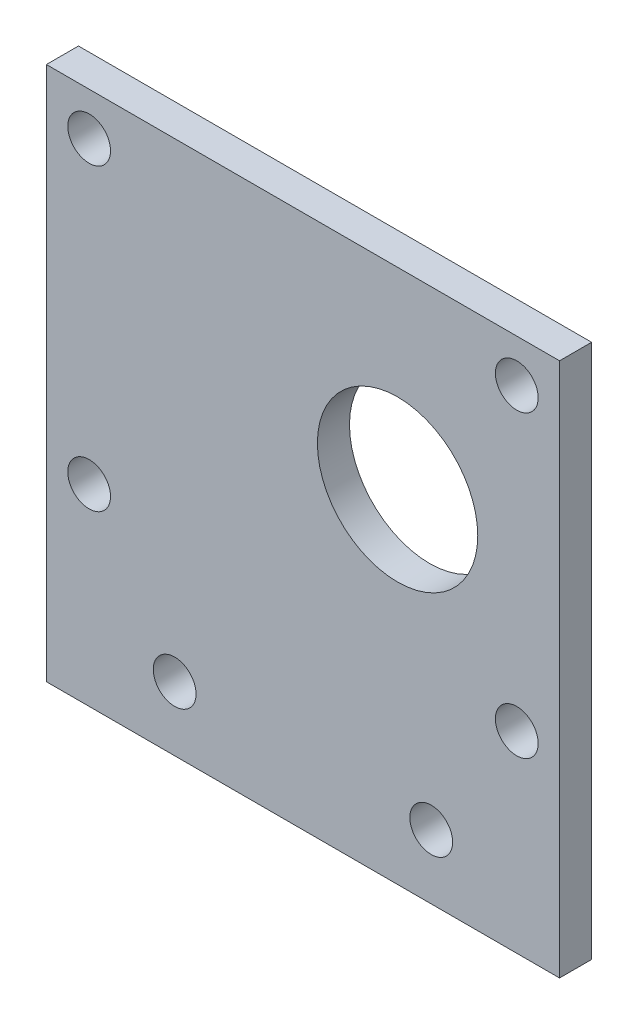
ISO-10303-21;
HEADER;
FILE_DESCRIPTION(('STEP AP214'),'2;1');
FILE_NAME('part.step','',(''),(''),'','','');
FILE_SCHEMA(('AUTOMOTIVE_DESIGN { 1 0 10303 214 1 1 1 1 }'));
ENDSEC;
DATA;
#1=APPLICATION_CONTEXT('core data for automotive mechanical design processes');
#2=APPLICATION_PROTOCOL_DEFINITION('international standard','automotive_design',2000,#1);
#3=PRODUCT_CONTEXT('',#1,'mechanical');
#4=PRODUCT('Part','Part','',(#3));
#5=PRODUCT_RELATED_PRODUCT_CATEGORY('part','',(#4));
#6=PRODUCT_DEFINITION_FORMATION('','',#4);
#7=PRODUCT_DEFINITION_CONTEXT('part definition',#1,'design');
#8=PRODUCT_DEFINITION('design','',#6,#7);
#9=PRODUCT_DEFINITION_SHAPE('','',#8);
#10=(LENGTH_UNIT() NAMED_UNIT(*) SI_UNIT(.MILLI.,.METRE.));
#11=(NAMED_UNIT(*) PLANE_ANGLE_UNIT() SI_UNIT($,.RADIAN.));
#12=(NAMED_UNIT(*) SI_UNIT($,.STERADIAN.) SOLID_ANGLE_UNIT());
#13=UNCERTAINTY_MEASURE_WITH_UNIT(LENGTH_MEASURE(1.E-05),#10,'distance_accuracy_value','');
#14=(GEOMETRIC_REPRESENTATION_CONTEXT(3) GLOBAL_UNCERTAINTY_ASSIGNED_CONTEXT((#13)) GLOBAL_UNIT_ASSIGNED_CONTEXT((#10,
#11,#12)) REPRESENTATION_CONTEXT('',''));
#15=CARTESIAN_POINT('',(0.,0.,0.));
#16=DIRECTION('',(0.,0.,1.));
#17=DIRECTION('',(1.,0.,0.));
#18=AXIS2_PLACEMENT_3D('',#15,#16,#17);
#19=CARTESIAN_POINT('',(0.,0.,3.));
#20=DIRECTION('',(0.,0.,-1.));
#21=DIRECTION('',(-1.,0.,0.));
#22=AXIS2_PLACEMENT_3D('',#19,#20,#21);
#23=PLANE('',#22);
#24=DIRECTION('',(0.,-1.,0.));
#25=VECTOR('',#24,1.);
#26=CARTESIAN_POINT('',(0.,0.,3.));
#27=LINE('',#26,#25);
#28=CARTESIAN_POINT('',(0.,50.,3.));
#29=VERTEX_POINT('',#28);
#30=CARTESIAN_POINT('',(0.,0.,3.));
#31=VERTEX_POINT('',#30);
#32=EDGE_CURVE('E86',#29,#31,#27,.T.);
#33=ORIENTED_EDGE('',*,*,#32,.T.);
#34=DIRECTION('',(1.,0.,0.));
#35=VECTOR('',#34,1.);
#36=CARTESIAN_POINT('',(0.,0.,3.));
#37=LINE('',#36,#35);
#38=CARTESIAN_POINT('',(48.,0.,3.));
#39=VERTEX_POINT('',#38);
#40=EDGE_CURVE('E81',#31,#39,#37,.T.);
#41=ORIENTED_EDGE('',*,*,#40,.T.);
#42=DIRECTION('',(0.,1.,0.));
#43=VECTOR('',#42,1.);
#44=CARTESIAN_POINT('',(48.,0.,3.));
#45=LINE('',#44,#43);
#46=CARTESIAN_POINT('',(48.,50.,3.));
#47=VERTEX_POINT('',#46);
#48=EDGE_CURVE('E84',#39,#47,#45,.T.);
#49=ORIENTED_EDGE('',*,*,#48,.T.);
#50=DIRECTION('',(-1.,0.,0.));
#51=VECTOR('',#50,1.);
#52=CARTESIAN_POINT('',(0.,50.,3.));
#53=LINE('',#52,#51);
#54=EDGE_CURVE('E51',#47,#29,#53,.T.);
#55=ORIENTED_EDGE('',*,*,#54,.T.);
#56=EDGE_LOOP('',(#33,#41,#49,#55));
#57=FACE_BOUND('',#56,.T.);
#58=CARTESIAN_POINT('',(4.,46.,3.));
#59=DIRECTION('',(0.,0.,1.));
#60=DIRECTION('',(1.,0.,0.));
#61=AXIS2_PLACEMENT_3D('',#58,#59,#60);
#62=CIRCLE('',#61,2.);
#63=CARTESIAN_POINT('',(6.,46.,3.));
#64=VERTEX_POINT('',#63);
#65=EDGE_CURVE('E101',#64,#64,#62,.T.);
#66=ORIENTED_EDGE('',*,*,#65,.F.);
#67=EDGE_LOOP('',(#66));
#68=FACE_BOUND('',#67,.T.);
#69=CARTESIAN_POINT('',(44.,46.,3.));
#70=DIRECTION('',(0.,0.,1.));
#71=DIRECTION('',(1.,0.,0.));
#72=AXIS2_PLACEMENT_3D('',#69,#70,#71);
#73=CIRCLE('',#72,2.);
#74=CARTESIAN_POINT('',(46.,46.,3.));
#75=VERTEX_POINT('',#74);
#76=EDGE_CURVE('E116',#75,#75,#73,.T.);
#77=ORIENTED_EDGE('',*,*,#76,.F.);
#78=EDGE_LOOP('',(#77));
#79=FACE_BOUND('',#78,.T.);
#80=CARTESIAN_POINT('',(44.,18.,3.));
#81=DIRECTION('',(0.,0.,1.));
#82=DIRECTION('',(1.,0.,0.));
#83=AXIS2_PLACEMENT_3D('',#80,#81,#82);
#84=CIRCLE('',#83,2.);
#85=CARTESIAN_POINT('',(46.,18.,3.));
#86=VERTEX_POINT('',#85);
#87=EDGE_CURVE('E122',#86,#86,#84,.T.);
#88=ORIENTED_EDGE('',*,*,#87,.F.);
#89=EDGE_LOOP('',(#88));
#90=FACE_BOUND('',#89,.T.);
#91=CARTESIAN_POINT('',(4.,18.,3.));
#92=DIRECTION('',(0.,0.,1.));
#93=DIRECTION('',(1.,0.,0.));
#94=AXIS2_PLACEMENT_3D('',#91,#92,#93);
#95=CIRCLE('',#94,2.);
#96=CARTESIAN_POINT('',(6.,18.,3.));
#97=VERTEX_POINT('',#96);
#98=EDGE_CURVE('E128',#97,#97,#95,.T.);
#99=ORIENTED_EDGE('',*,*,#98,.F.);
#100=EDGE_LOOP('',(#99));
#101=FACE_BOUND('',#100,.T.);
#102=CARTESIAN_POINT('',(12.,6.,3.));
#103=DIRECTION('',(0.,0.,1.));
#104=DIRECTION('',(1.,0.,0.));
#105=AXIS2_PLACEMENT_3D('',#102,#103,#104);
#106=CIRCLE('',#105,2.);
#107=CARTESIAN_POINT('',(14.,6.,3.));
#108=VERTEX_POINT('',#107);
#109=EDGE_CURVE('E134',#108,#108,#106,.T.);
#110=ORIENTED_EDGE('',*,*,#109,.F.);
#111=EDGE_LOOP('',(#110));
#112=FACE_BOUND('',#111,.T.);
#113=CARTESIAN_POINT('',(32.85,32.,3.));
#114=DIRECTION('',(0.,0.,1.));
#115=DIRECTION('',(1.,0.,0.));
#116=AXIS2_PLACEMENT_3D('',#113,#114,#115);
#117=CIRCLE('',#116,7.5);
#118=CARTESIAN_POINT('',(40.35,32.,3.));
#119=VERTEX_POINT('',#118);
#120=EDGE_CURVE('E140',#119,#119,#117,.T.);
#121=ORIENTED_EDGE('',*,*,#120,.F.);
#122=EDGE_LOOP('',(#121));
#123=FACE_BOUND('',#122,.T.);
#124=CARTESIAN_POINT('',(36.,6.,3.));
#125=DIRECTION('',(0.,0.,1.));
#126=DIRECTION('',(1.,0.,0.));
#127=AXIS2_PLACEMENT_3D('',#124,#125,#126);
#128=CIRCLE('',#127,2.);
#129=CARTESIAN_POINT('',(38.,6.,3.));
#130=VERTEX_POINT('',#129);
#131=EDGE_CURVE('E146',#130,#130,#128,.T.);
#132=ORIENTED_EDGE('',*,*,#131,.F.);
#133=EDGE_LOOP('',(#132));
#134=FACE_BOUND('',#133,.T.);
#135=ADVANCED_FACE('F34',(#57,#68,#79,#90,#101,#112,#123,#134),#23,.F.);
#136=CARTESIAN_POINT('',(0.,0.,0.));
#137=DIRECTION('',(0.,0.,-1.));
#138=DIRECTION('',(-1.,0.,0.));
#139=AXIS2_PLACEMENT_3D('',#136,#137,#138);
#140=PLANE('',#139);
#141=CARTESIAN_POINT('',(32.85,32.,0.));
#142=DIRECTION('',(0.,0.,1.));
#143=DIRECTION('',(1.,0.,0.));
#144=AXIS2_PLACEMENT_3D('',#141,#142,#143);
#145=CIRCLE('',#144,7.5);
#146=CARTESIAN_POINT('',(40.35,32.,0.));
#147=VERTEX_POINT('',#146);
#148=EDGE_CURVE('E143',#147,#147,#145,.T.);
#149=ORIENTED_EDGE('',*,*,#148,.T.);
#150=EDGE_LOOP('',(#149));
#151=FACE_BOUND('',#150,.T.);
#152=CARTESIAN_POINT('',(4.,18.,0.));
#153=DIRECTION('',(0.,0.,1.));
#154=DIRECTION('',(1.,0.,0.));
#155=AXIS2_PLACEMENT_3D('',#152,#153,#154);
#156=CIRCLE('',#155,2.);
#157=CARTESIAN_POINT('',(6.,18.,0.));
#158=VERTEX_POINT('',#157);
#159=EDGE_CURVE('E131',#158,#158,#156,.T.);
#160=ORIENTED_EDGE('',*,*,#159,.T.);
#161=EDGE_LOOP('',(#160));
#162=FACE_BOUND('',#161,.T.);
#163=CARTESIAN_POINT('',(44.,46.,0.));
#164=DIRECTION('',(0.,0.,1.));
#165=DIRECTION('',(1.,0.,0.));
#166=AXIS2_PLACEMENT_3D('',#163,#164,#165);
#167=CIRCLE('',#166,2.);
#168=CARTESIAN_POINT('',(46.,46.,0.));
#169=VERTEX_POINT('',#168);
#170=EDGE_CURVE('E119',#169,#169,#167,.T.);
#171=ORIENTED_EDGE('',*,*,#170,.T.);
#172=EDGE_LOOP('',(#171));
#173=FACE_BOUND('',#172,.T.);
#174=DIRECTION('',(0.,-1.,0.));
#175=VECTOR('',#174,1.);
#176=CARTESIAN_POINT('',(0.,0.,0.));
#177=LINE('',#176,#175);
#178=CARTESIAN_POINT('',(0.,50.,0.));
#179=VERTEX_POINT('',#178);
#180=CARTESIAN_POINT('',(0.,0.,0.));
#181=VERTEX_POINT('',#180);
#182=EDGE_CURVE('E98',#179,#181,#177,.T.);
#183=ORIENTED_EDGE('',*,*,#182,.F.);
#184=DIRECTION('',(-1.,0.,0.));
#185=VECTOR('',#184,1.);
#186=CARTESIAN_POINT('',(0.,50.,0.));
#187=LINE('',#186,#185);
#188=CARTESIAN_POINT('',(48.,50.,0.));
#189=VERTEX_POINT('',#188);
#190=EDGE_CURVE('E74',#189,#179,#187,.T.);
#191=ORIENTED_EDGE('',*,*,#190,.F.);
#192=DIRECTION('',(0.,1.,0.));
#193=VECTOR('',#192,1.);
#194=CARTESIAN_POINT('',(48.,0.,0.));
#195=LINE('',#194,#193);
#196=CARTESIAN_POINT('',(48.,0.,0.));
#197=VERTEX_POINT('',#196);
#198=EDGE_CURVE('E68',#197,#189,#195,.T.);
#199=ORIENTED_EDGE('',*,*,#198,.F.);
#200=DIRECTION('',(1.,0.,0.));
#201=VECTOR('',#200,1.);
#202=CARTESIAN_POINT('',(0.,0.,0.));
#203=LINE('',#202,#201);
#204=EDGE_CURVE('E90',#181,#197,#203,.T.);
#205=ORIENTED_EDGE('',*,*,#204,.F.);
#206=EDGE_LOOP('',(#183,#191,#199,#205));
#207=FACE_BOUND('',#206,.T.);
#208=CARTESIAN_POINT('',(4.,46.,0.));
#209=DIRECTION('',(0.,0.,1.));
#210=DIRECTION('',(1.,0.,0.));
#211=AXIS2_PLACEMENT_3D('',#208,#209,#210);
#212=CIRCLE('',#211,2.);
#213=CARTESIAN_POINT('',(6.,46.,0.));
#214=VERTEX_POINT('',#213);
#215=EDGE_CURVE('E113',#214,#214,#212,.T.);
#216=ORIENTED_EDGE('',*,*,#215,.T.);
#217=EDGE_LOOP('',(#216));
#218=FACE_BOUND('',#217,.T.);
#219=CARTESIAN_POINT('',(44.,18.,0.));
#220=DIRECTION('',(0.,0.,1.));
#221=DIRECTION('',(1.,0.,0.));
#222=AXIS2_PLACEMENT_3D('',#219,#220,#221);
#223=CIRCLE('',#222,2.);
#224=CARTESIAN_POINT('',(46.,18.,0.));
#225=VERTEX_POINT('',#224);
#226=EDGE_CURVE('E125',#225,#225,#223,.T.);
#227=ORIENTED_EDGE('',*,*,#226,.T.);
#228=EDGE_LOOP('',(#227));
#229=FACE_BOUND('',#228,.T.);
#230=CARTESIAN_POINT('',(12.,6.,0.));
#231=DIRECTION('',(0.,0.,1.));
#232=DIRECTION('',(1.,0.,0.));
#233=AXIS2_PLACEMENT_3D('',#230,#231,#232);
#234=CIRCLE('',#233,2.);
#235=CARTESIAN_POINT('',(14.,6.,0.));
#236=VERTEX_POINT('',#235);
#237=EDGE_CURVE('E137',#236,#236,#234,.T.);
#238=ORIENTED_EDGE('',*,*,#237,.T.);
#239=EDGE_LOOP('',(#238));
#240=FACE_BOUND('',#239,.T.);
#241=CARTESIAN_POINT('',(36.,6.,0.));
#242=DIRECTION('',(0.,0.,1.));
#243=DIRECTION('',(1.,0.,0.));
#244=AXIS2_PLACEMENT_3D('',#241,#242,#243);
#245=CIRCLE('',#244,2.);
#246=CARTESIAN_POINT('',(38.,6.,0.));
#247=VERTEX_POINT('',#246);
#248=EDGE_CURVE('E149',#247,#247,#245,.T.);
#249=ORIENTED_EDGE('',*,*,#248,.T.);
#250=EDGE_LOOP('',(#249));
#251=FACE_BOUND('',#250,.T.);
#252=ADVANCED_FACE('F109',(#151,#162,#173,#207,#218,#229,#240,#251),#140,.T.);
#253=CARTESIAN_POINT('',(0.,0.,3.));
#254=DIRECTION('',(1.,0.,0.));
#255=DIRECTION('',(0.,0.,-1.));
#256=AXIS2_PLACEMENT_3D('',#253,#254,#255);
#257=PLANE('',#256);
#258=ORIENTED_EDGE('',*,*,#182,.T.);
#259=DIRECTION('',(0.,0.,-1.));
#260=VECTOR('',#259,1.);
#261=CARTESIAN_POINT('',(0.,0.,3.));
#262=LINE('',#261,#260);
#263=EDGE_CURVE('E11',#31,#181,#262,.T.);
#264=ORIENTED_EDGE('',*,*,#263,.F.);
#265=ORIENTED_EDGE('',*,*,#32,.F.);
#266=DIRECTION('',(0.,0.,-1.));
#267=VECTOR('',#266,1.);
#268=CARTESIAN_POINT('',(0.,50.,3.));
#269=LINE('',#268,#267);
#270=EDGE_CURVE('E94',#29,#179,#269,.T.);
#271=ORIENTED_EDGE('',*,*,#270,.T.);
#272=EDGE_LOOP('',(#258,#264,#265,#271));
#273=FACE_BOUND('',#272,.T.);
#274=ADVANCED_FACE('F36',(#273),#257,.F.);
#275=CARTESIAN_POINT('',(0.,0.,3.));
#276=DIRECTION('',(0.,1.,0.));
#277=DIRECTION('',(0.,0.,1.));
#278=AXIS2_PLACEMENT_3D('',#275,#276,#277);
#279=PLANE('',#278);
#280=ORIENTED_EDGE('',*,*,#204,.T.);
#281=DIRECTION('',(0.,0.,-1.));
#282=VECTOR('',#281,1.);
#283=CARTESIAN_POINT('',(48.,0.,3.));
#284=LINE('',#283,#282);
#285=EDGE_CURVE('E43',#39,#197,#284,.T.);
#286=ORIENTED_EDGE('',*,*,#285,.F.);
#287=ORIENTED_EDGE('',*,*,#40,.F.);
#288=ORIENTED_EDGE('',*,*,#263,.T.);
#289=EDGE_LOOP('',(#280,#286,#287,#288));
#290=FACE_BOUND('',#289,.T.);
#291=ADVANCED_FACE('F89',(#290),#279,.F.);
#292=CARTESIAN_POINT('',(48.,0.,3.));
#293=DIRECTION('',(-1.,0.,0.));
#294=DIRECTION('',(0.,0.,1.));
#295=AXIS2_PLACEMENT_3D('',#292,#293,#294);
#296=PLANE('',#295);
#297=ORIENTED_EDGE('',*,*,#198,.T.);
#298=DIRECTION('',(0.,0.,-1.));
#299=VECTOR('',#298,1.);
#300=CARTESIAN_POINT('',(48.,50.,3.));
#301=LINE('',#300,#299);
#302=EDGE_CURVE('E91',#47,#189,#301,.T.);
#303=ORIENTED_EDGE('',*,*,#302,.F.);
#304=ORIENTED_EDGE('',*,*,#48,.F.);
#305=ORIENTED_EDGE('',*,*,#285,.T.);
#306=EDGE_LOOP('',(#297,#303,#304,#305));
#307=FACE_BOUND('',#306,.T.);
#308=ADVANCED_FACE('F92',(#307),#296,.F.);
#309=CARTESIAN_POINT('',(0.,50.,3.));
#310=DIRECTION('',(0.,-1.,0.));
#311=DIRECTION('',(0.,0.,-1.));
#312=AXIS2_PLACEMENT_3D('',#309,#310,#311);
#313=PLANE('',#312);
#314=ORIENTED_EDGE('',*,*,#190,.T.);
#315=ORIENTED_EDGE('',*,*,#270,.F.);
#316=ORIENTED_EDGE('',*,*,#54,.F.);
#317=ORIENTED_EDGE('',*,*,#302,.T.);
#318=EDGE_LOOP('',(#314,#315,#316,#317));
#319=FACE_BOUND('',#318,.T.);
#320=ADVANCED_FACE('F106',(#319),#313,.F.);
#321=CARTESIAN_POINT('',(4.,46.,3.));
#322=DIRECTION('',(0.,0.,-1.));
#323=DIRECTION('',(-1.,0.,0.));
#324=AXIS2_PLACEMENT_3D('',#321,#322,#323);
#325=CYLINDRICAL_SURFACE('',#324,2.);
#326=ORIENTED_EDGE('',*,*,#65,.T.);
#327=EDGE_LOOP('',(#326));
#328=FACE_BOUND('',#327,.T.);
#329=ORIENTED_EDGE('',*,*,#215,.F.);
#330=EDGE_LOOP('',(#329));
#331=FACE_BOUND('',#330,.T.);
#332=ADVANCED_FACE('F166',(#328,#331),#325,.F.);
#333=CARTESIAN_POINT('',(44.,46.,3.));
#334=DIRECTION('',(0.,0.,-1.));
#335=DIRECTION('',(-1.,0.,0.));
#336=AXIS2_PLACEMENT_3D('',#333,#334,#335);
#337=CYLINDRICAL_SURFACE('',#336,2.);
#338=ORIENTED_EDGE('',*,*,#76,.T.);
#339=EDGE_LOOP('',(#338));
#340=FACE_BOUND('',#339,.T.);
#341=ORIENTED_EDGE('',*,*,#170,.F.);
#342=EDGE_LOOP('',(#341));
#343=FACE_BOUND('',#342,.T.);
#344=ADVANCED_FACE('F212',(#340,#343),#337,.F.);
#345=CARTESIAN_POINT('',(44.,18.,3.));
#346=DIRECTION('',(0.,0.,-1.));
#347=DIRECTION('',(-1.,0.,0.));
#348=AXIS2_PLACEMENT_3D('',#345,#346,#347);
#349=CYLINDRICAL_SURFACE('',#348,2.);
#350=ORIENTED_EDGE('',*,*,#87,.T.);
#351=EDGE_LOOP('',(#350));
#352=FACE_BOUND('',#351,.T.);
#353=ORIENTED_EDGE('',*,*,#226,.F.);
#354=EDGE_LOOP('',(#353));
#355=FACE_BOUND('',#354,.T.);
#356=ADVANCED_FACE('F220',(#352,#355),#349,.F.);
#357=CARTESIAN_POINT('',(4.,18.,3.));
#358=DIRECTION('',(0.,0.,-1.));
#359=DIRECTION('',(-1.,0.,0.));
#360=AXIS2_PLACEMENT_3D('',#357,#358,#359);
#361=CYLINDRICAL_SURFACE('',#360,2.);
#362=ORIENTED_EDGE('',*,*,#98,.T.);
#363=EDGE_LOOP('',(#362));
#364=FACE_BOUND('',#363,.T.);
#365=ORIENTED_EDGE('',*,*,#159,.F.);
#366=EDGE_LOOP('',(#365));
#367=FACE_BOUND('',#366,.T.);
#368=ADVANCED_FACE('F228',(#364,#367),#361,.F.);
#369=CARTESIAN_POINT('',(12.,6.,3.));
#370=DIRECTION('',(0.,0.,-1.));
#371=DIRECTION('',(-1.,0.,0.));
#372=AXIS2_PLACEMENT_3D('',#369,#370,#371);
#373=CYLINDRICAL_SURFACE('',#372,2.);
#374=ORIENTED_EDGE('',*,*,#109,.T.);
#375=EDGE_LOOP('',(#374));
#376=FACE_BOUND('',#375,.T.);
#377=ORIENTED_EDGE('',*,*,#237,.F.);
#378=EDGE_LOOP('',(#377));
#379=FACE_BOUND('',#378,.T.);
#380=ADVANCED_FACE('F237',(#376,#379),#373,.F.);
#381=CARTESIAN_POINT('',(32.85,32.,3.));
#382=DIRECTION('',(0.,0.,-1.));
#383=DIRECTION('',(-1.,0.,0.));
#384=AXIS2_PLACEMENT_3D('',#381,#382,#383);
#385=CYLINDRICAL_SURFACE('',#384,7.5);
#386=ORIENTED_EDGE('',*,*,#120,.T.);
#387=EDGE_LOOP('',(#386));
#388=FACE_BOUND('',#387,.T.);
#389=ORIENTED_EDGE('',*,*,#148,.F.);
#390=EDGE_LOOP('',(#389));
#391=FACE_BOUND('',#390,.T.);
#392=ADVANCED_FACE('F246',(#388,#391),#385,.F.);
#393=CARTESIAN_POINT('',(36.,6.,3.));
#394=DIRECTION('',(0.,0.,-1.));
#395=DIRECTION('',(-1.,0.,0.));
#396=AXIS2_PLACEMENT_3D('',#393,#394,#395);
#397=CYLINDRICAL_SURFACE('',#396,2.);
#398=ORIENTED_EDGE('',*,*,#131,.T.);
#399=EDGE_LOOP('',(#398));
#400=FACE_BOUND('',#399,.T.);
#401=ORIENTED_EDGE('',*,*,#248,.F.);
#402=EDGE_LOOP('',(#401));
#403=FACE_BOUND('',#402,.T.);
#404=ADVANCED_FACE('F155',(#400,#403),#397,.F.);
#405=CLOSED_SHELL('',(#135,#252,#274,#291,#308,#320,#332,#344,#356,#368,#380,#392,#404));
#406=MANIFOLD_SOLID_BREP('B2',#405);
#407=ADVANCED_BREP_SHAPE_REPRESENTATION('',(#18,#406),#14);
#408=SHAPE_DEFINITION_REPRESENTATION(#9,#407);
ENDSEC;
END-ISO-10303-21;
